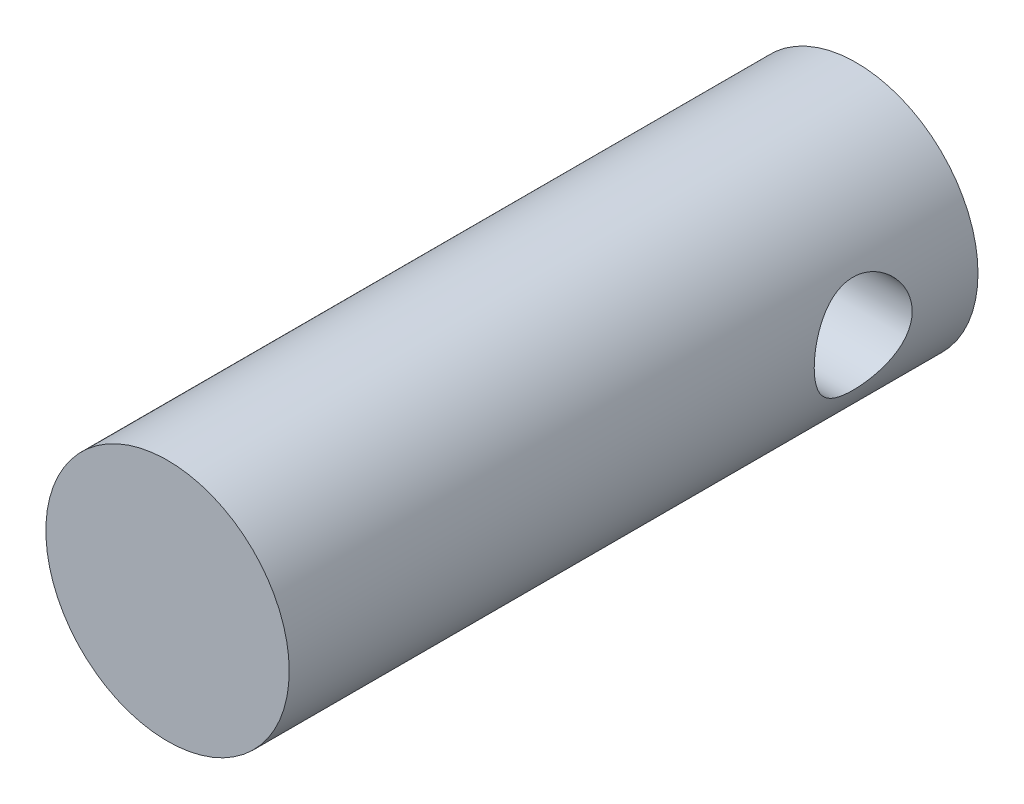
ISO-10303-21;
HEADER;
FILE_DESCRIPTION(('STEP AP214'),'2;1');
FILE_NAME('part.step','',(''),(''),'','','');
FILE_SCHEMA(('AUTOMOTIVE_DESIGN { 1 0 10303 214 1 1 1 1 }'));
ENDSEC;
DATA;
#1=APPLICATION_CONTEXT('core data for automotive mechanical design processes');
#2=APPLICATION_PROTOCOL_DEFINITION('international standard','automotive_design',2000,#1);
#3=PRODUCT_CONTEXT('',#1,'mechanical');
#4=PRODUCT('Part','Part','',(#3));
#5=PRODUCT_RELATED_PRODUCT_CATEGORY('part','',(#4));
#6=PRODUCT_DEFINITION_FORMATION('','',#4);
#7=PRODUCT_DEFINITION_CONTEXT('part definition',#1,'design');
#8=PRODUCT_DEFINITION('design','',#6,#7);
#9=PRODUCT_DEFINITION_SHAPE('','',#8);
#10=(LENGTH_UNIT() NAMED_UNIT(*) SI_UNIT(.MILLI.,.METRE.));
#11=(NAMED_UNIT(*) PLANE_ANGLE_UNIT() SI_UNIT($,.RADIAN.));
#12=(NAMED_UNIT(*) SI_UNIT($,.STERADIAN.) SOLID_ANGLE_UNIT());
#13=UNCERTAINTY_MEASURE_WITH_UNIT(LENGTH_MEASURE(1.E-05),#10,'distance_accuracy_value','');
#14=(GEOMETRIC_REPRESENTATION_CONTEXT(3) GLOBAL_UNCERTAINTY_ASSIGNED_CONTEXT((#13)) GLOBAL_UNIT_ASSIGNED_CONTEXT((#10,
#11,#12)) REPRESENTATION_CONTEXT('',''));
#15=CARTESIAN_POINT('',(0.,0.,0.));
#16=DIRECTION('',(0.,0.,1.));
#17=DIRECTION('',(1.,0.,0.));
#18=AXIS2_PLACEMENT_3D('',#15,#16,#17);
#19=CARTESIAN_POINT('',(0.,0.,90.));
#20=DIRECTION('',(0.,0.,-1.));
#21=DIRECTION('',(-1.,0.,0.));
#22=AXIS2_PLACEMENT_3D('',#19,#20,#21);
#23=CYLINDRICAL_SURFACE('',#22,15.9);
#24=CARTESIAN_POINT('',(15.9,0.,8.60000000000005));
#25=CARTESIAN_POINT('',(15.8999992046562,-0.171980779036634,8.60000101579485));
#26=CARTESIAN_POINT('',(15.8972019298914,-0.344026681142329,8.6069417407459));
#27=CARTESIAN_POINT('',(15.8860828247378,-0.686900204498582,8.63464182974731));
#28=CARTESIAN_POINT('',(15.8777573333585,-0.857726942549671,8.65541035110304));
#29=CARTESIAN_POINT('',(15.8557787232932,-1.19719142710894,8.71061519070985));
#30=CARTESIAN_POINT('',(15.8421142571649,-1.36582371543756,8.74508062302765));
#31=CARTESIAN_POINT('',(15.8098132722622,-1.69938160913937,8.8273485633869));
#32=CARTESIAN_POINT('',(15.7911747217829,-1.86430566994386,8.87515652165675));
#33=CARTESIAN_POINT('',(15.749488448008,-2.18866449638451,8.9834500970956));
#34=CARTESIAN_POINT('',(15.7264574211853,-2.34811743403703,9.04388778740796));
#35=CARTESIAN_POINT('',(15.6765097403794,-2.66123915728213,9.17704830458091));
#36=CARTESIAN_POINT('',(15.6495916353706,-2.81490575573804,9.24977572086352));
#37=CARTESIAN_POINT('',(15.5925519068847,-3.11539498879065,9.40687675256024));
#38=CARTESIAN_POINT('',(15.5624327518265,-3.2622227731112,9.49124140891638));
#39=CARTESIAN_POINT('',(15.4996929804974,-3.54838256121094,9.6710625719418));
#40=CARTESIAN_POINT('',(15.4670714600248,-3.68771182424525,9.76652309445882));
#41=CARTESIAN_POINT('',(15.3637094634824,-4.10494997766084,10.0773075510603));
#42=CARTESIAN_POINT('',(15.2900042466172,-4.36923869957476,10.3103275985045));
#43=CARTESIAN_POINT('',(15.1424065959405,-4.85618110327394,10.8165878470021));
#44=CARTESIAN_POINT('',(15.0685140877324,-5.07881419015128,11.0898478243449));
#45=CARTESIAN_POINT('',(14.9618627232137,-5.38190089373184,11.5317053841374));
#46=CARTESIAN_POINT('',(14.9262900066365,-5.47953249507688,11.6880831703871));
#47=CARTESIAN_POINT('',(14.858344219881,-5.66118399891776,12.0091844038552));
#48=CARTESIAN_POINT('',(14.8259698347619,-5.74520950449056,12.1739043788336));
#49=CARTESIAN_POINT('',(14.7654790200851,-5.89893729754548,12.5106609958747));
#50=CARTESIAN_POINT('',(14.7373628633161,-5.96863866750316,12.682698105781));
#51=CARTESIAN_POINT('',(14.686385383696,-6.09299634195365,13.0327994824035));
#52=CARTESIAN_POINT('',(14.6635214193468,-6.14766021203765,13.2108606674909));
#53=CARTESIAN_POINT('',(14.624778529459,-6.23924784694049,13.5635262184435));
#54=CARTESIAN_POINT('',(14.6086299011431,-6.2768635823761,13.7379212657773));
#55=CARTESIAN_POINT('',(14.5824573630195,-6.33743086259205,14.0896202958677));
#56=CARTESIAN_POINT('',(14.5724306778774,-6.36038905247019,14.2669229230055));
#57=CARTESIAN_POINT('',(14.5588615840443,-6.39138773156405,14.6230370545568));
#58=CARTESIAN_POINT('',(14.5553177620069,-6.39943147232402,14.8018482215475));
#59=CARTESIAN_POINT('',(14.5548435634636,-6.4005102311764,15.15952034877));
#60=CARTESIAN_POINT('',(14.5579128727916,-6.39354596224534,15.3383813062328));
#61=CARTESIAN_POINT('',(14.5700985332043,-6.36572337785981,15.6820134716738));
#62=CARTESIAN_POINT('',(14.5787706047808,-6.34588542331798,15.8468843420816));
#63=CARTESIAN_POINT('',(14.6014473318304,-6.29353233142194,16.1742833460062));
#64=CARTESIAN_POINT('',(14.6154537406496,-6.26101302574378,16.3368106909791));
#65=CARTESIAN_POINT('',(14.6483626285174,-6.18362644326438,16.6583434764584));
#66=CARTESIAN_POINT('',(14.6672639377121,-6.13876211669411,16.8173497486386));
#67=CARTESIAN_POINT('',(14.7094127472312,-6.03706914652594,17.1309578704793));
#68=CARTESIAN_POINT('',(14.7326619182897,-5.98023590262147,17.2855580006049));
#69=CARTESIAN_POINT('',(14.7833534465297,-5.85381829324504,17.5924715484894));
#70=CARTESIAN_POINT('',(14.8108708346101,-5.78400013929312,17.744676175697));
#71=CARTESIAN_POINT('',(14.8689898197706,-5.63291150693005,18.0427350302866));
#72=CARTESIAN_POINT('',(14.8995924598104,-5.55163715206476,18.1885870861807));
#73=CARTESIAN_POINT('',(14.9630749112561,-5.37818889802826,18.4731621221998));
#74=CARTESIAN_POINT('',(14.9959550320767,-5.28601351665445,18.6118841291713));
#75=CARTESIAN_POINT('',(15.0631677015387,-5.09132431569727,18.881503590249));
#76=CARTESIAN_POINT('',(15.0975003260537,-4.98880995565572,19.0124006347441));
#77=CARTESIAN_POINT('',(15.1695190483268,-4.76555400222129,19.2756964832055));
#78=CARTESIAN_POINT('',(15.2072566046043,-4.64401305838589,19.4074044723956));
#79=CARTESIAN_POINT('',(15.2824291858421,-4.39031372358851,19.6601718078636));
#80=CARTESIAN_POINT('',(15.3198642964914,-4.25815846492082,19.7812342737146));
#81=CARTESIAN_POINT('',(15.3934716045971,-3.98386785351345,20.0120798831525));
#82=CARTESIAN_POINT('',(15.4296430560319,-3.84172674971576,20.1218564358018));
#83=CARTESIAN_POINT('',(15.4997275289986,-3.54840418418615,20.3292662209025));
#84=CARTESIAN_POINT('',(15.5336414500985,-3.39722636948439,20.4269043038433));
#85=CARTESIAN_POINT('',(15.5989923654703,-3.0834466106694,20.6112518623245));
#86=CARTESIAN_POINT('',(15.6303633692958,-2.9206727177749,20.6976925602306));
#87=CARTESIAN_POINT('',(15.6889218536697,-2.5877184386177,20.8564247524691));
#88=CARTESIAN_POINT('',(15.7161110184857,-2.4175410697759,20.9287219464129));
#89=CARTESIAN_POINT('',(15.7655242719524,-2.07095973742492,21.0584945992748));
#90=CARTESIAN_POINT('',(15.7877493686396,-1.89455704651151,21.1159730677482));
#91=CARTESIAN_POINT('',(15.8265740021245,-1.53685050875672,21.2155086838733));
#92=CARTESIAN_POINT('',(15.8431739339858,-1.35554700707256,21.2575669145281));
#93=CARTESIAN_POINT('',(15.8694302386116,-1.00047851244443,21.3237393494539));
#94=CARTESIAN_POINT('',(15.8794425938282,-0.826911406704495,21.3487765161915));
#95=CARTESIAN_POINT('',(15.8937694567169,-0.478077479010072,21.3845264334986));
#96=CARTESIAN_POINT('',(15.898084249591,-0.302810742576149,21.3952399010674));
#97=CARTESIAN_POINT('',(15.9008949797389,0.0480167596019802,21.4022239112365));
#98=CARTESIAN_POINT('',(15.899392218756,0.223577450783179,21.398497684881));
#99=CARTESIAN_POINT('',(15.890612874211,0.573652873036684,21.376650995696));
#100=CARTESIAN_POINT('',(15.8833364038866,0.748167624555007,21.35853081517));
#101=CARTESIAN_POINT('',(15.8636759910127,1.08684371917325,21.3092550019988));
#102=CARTESIAN_POINT('',(15.8515417039289,1.25111271986699,21.2787355984077));
#103=CARTESIAN_POINT('',(15.8225026204763,1.57641555386155,21.2050572492848));
#104=CARTESIAN_POINT('',(15.8055962643291,1.73744831091186,21.1618941709199));
#105=CARTESIAN_POINT('',(15.7674344048377,2.05514109149949,21.063336527423));
#106=CARTESIAN_POINT('',(15.7461801115466,2.21180231790048,21.0079453650902));
#107=CARTESIAN_POINT('',(15.6998191075175,2.51991334570503,20.8853664900806));
#108=CARTESIAN_POINT('',(15.6747109314594,2.671361137933,20.8181742890148));
#109=CARTESIAN_POINT('',(15.6204223535534,2.97263156069611,20.6703143629803));
#110=CARTESIAN_POINT('',(15.5911416258518,3.12226595280605,20.5893000587608));
#111=CARTESIAN_POINT('',(15.5298155195094,3.41424889554771,20.4158793419747));
#112=CARTESIAN_POINT('',(15.4977691948828,3.55659492642112,20.323469026674));
#113=CARTESIAN_POINT('',(15.4316760705943,3.83322344572601,20.1278746395005));
#114=CARTESIAN_POINT('',(15.3976289303789,3.96750455353755,20.0246887312065));
#115=CARTESIAN_POINT('',(15.3283406318083,4.22729834005113,19.8081748158737));
#116=CARTESIAN_POINT('',(15.2930994206059,4.35281062990686,19.6948463595794));
#117=CARTESIAN_POINT('',(15.2198779513594,4.60253878964319,19.450745197925));
#118=CARTESIAN_POINT('',(15.1818725424002,4.72610284685502,19.31931226977));
#119=CARTESIAN_POINT('',(15.1065019443627,4.96174371208003,19.0464291231229));
#120=CARTESIAN_POINT('',(15.0691365601505,5.07382407514638,18.9049820278259));
#121=CARTESIAN_POINT('',(14.996064959701,5.28588912620612,18.6127531627669));
#122=CARTESIAN_POINT('',(14.9603597176574,5.38586676598188,18.4619660302103));
#123=CARTESIAN_POINT('',(14.8916994970906,5.57289961712084,18.1520674870494));
#124=CARTESIAN_POINT('',(14.8587433657092,5.65996025736234,17.9929596118102));
#125=CARTESIAN_POINT('',(14.796252257462,5.8213826771679,17.6655532879886));
#126=CARTESIAN_POINT('',(14.7667583250609,5.89559626547635,17.4971737895017));
#127=CARTESIAN_POINT('',(14.7126195767109,6.02943113605665,17.1540326649408));
#128=CARTESIAN_POINT('',(14.6879726821792,6.08905867603376,16.9792738128485));
#129=CARTESIAN_POINT('',(14.6444042866243,6.19310975450465,16.6246599616867));
#130=CARTESIAN_POINT('',(14.6254804604948,6.23753946837111,16.4448070647373));
#131=CARTESIAN_POINT('',(14.5940618972613,6.31070122141686,16.0813868297466));
#132=CARTESIAN_POINT('',(14.5815666122505,6.33943459841346,15.8978198096479));
#133=CARTESIAN_POINT('',(14.5641515520773,6.37933563308827,15.5419946822661));
#134=CARTESIAN_POINT('',(14.5587466469697,6.39162945768454,15.3698857759562));
#135=CARTESIAN_POINT('',(14.5540694038607,6.40227305916049,15.0251564873787));
#136=CARTESIAN_POINT('',(14.5547967983399,6.40062344431801,14.8525361277517));
#137=CARTESIAN_POINT('',(14.5623583031283,6.38340091413453,14.5081508015));
#138=CARTESIAN_POINT('',(14.5691916563495,6.36782972495292,14.3363857314816));
#139=CARTESIAN_POINT('',(14.5887277650361,6.32294389293203,13.9950025762418));
#140=CARTESIAN_POINT('',(14.601430490736,6.29362931978993,13.8253844801368));
#141=CARTESIAN_POINT('',(14.631646666526,6.22304767608885,13.4963986042574));
#142=CARTESIAN_POINT('',(14.6489425167004,6.1823174995948,13.336895073415));
#143=CARTESIAN_POINT('',(14.6880303399516,6.08886922423271,13.021954504783));
#144=CARTESIAN_POINT('',(14.7098237764038,6.03614722302409,12.8665188091358));
#145=CARTESIAN_POINT('',(14.7572846200712,5.91916635648656,12.5606836643214));
#146=CARTESIAN_POINT('',(14.7829515146057,5.85490901773155,12.4102835518719));
#147=CARTESIAN_POINT('',(14.8374708635361,5.71533636170774,12.1152829722362));
#148=CARTESIAN_POINT('',(14.8663244745706,5.64001702612599,11.9706846369728));
#149=CARTESIAN_POINT('',(14.9600199944031,5.38896238505551,11.5305207292207));
#150=CARTESIAN_POINT('',(15.0291618180781,5.19479618080253,11.2461257910192));
#151=CARTESIAN_POINT('',(15.1712090270879,4.76399896256803,10.7125808220985));
#152=CARTESIAN_POINT('',(15.2441155678605,4.52735485575308,10.4634417006329));
#153=CARTESIAN_POINT('',(15.3532526130609,4.13614274027789,10.1126912440407));
#154=CARTESIAN_POINT('',(15.3907289227547,3.99477410370612,9.99646958681593));
#155=CARTESIAN_POINT('',(15.4636897415585,3.70229344921914,9.77635332911503));
#156=CARTESIAN_POINT('',(15.4991749767738,3.55118502697824,9.67245421925271));
#157=CARTESIAN_POINT('',(15.5672067392973,3.23998034715245,9.47765762898821));
#158=CARTESIAN_POINT('',(15.5997504783079,3.0798757902839,9.38677243802486));
#159=CARTESIAN_POINT('',(15.6609338092513,2.75190077341183,9.21891397471958));
#160=CARTESIAN_POINT('',(15.6895751858439,2.58403391069327,9.14193433769463));
#161=CARTESIAN_POINT('',(15.7416740245942,2.2446908332941,9.00380785313219));
#162=CARTESIAN_POINT('',(15.7652149271866,2.07333260867143,8.9424028128873));
#163=CARTESIAN_POINT('',(15.8070660292477,1.72549289722599,8.83430283618504));
#164=CARTESIAN_POINT('',(15.8253786888982,1.5490138632426,8.78760097998742));
#165=CARTESIAN_POINT('',(15.8562103860179,1.192685219413,8.70947590910469));
#166=CARTESIAN_POINT('',(15.8687439334392,1.01284524379849,8.67801441937969));
#167=CARTESIAN_POINT('',(15.8877030894662,0.650907303351227,8.63057401569034));
#168=CARTESIAN_POINT('',(15.8941333013184,0.468811145355432,8.6145834331109));
#169=CARTESIAN_POINT('',(15.8982801359629,0.238689885047848,8.60427399774469));
#170=CARTESIAN_POINT('',(15.8989247954345,0.190969696197969,8.60267161556677));
#171=CARTESIAN_POINT('',(15.899784837858,0.0955013451901639,8.6005344757058));
#172=CARTESIAN_POINT('',(15.9000002208398,0.0477531830341818,8.59999971794856));
#173=CARTESIAN_POINT('',(15.9,0.,8.60000000000005));
#174=B_SPLINE_CURVE_WITH_KNOTS('',3,(#24,#25,#26,#27,#28,#29,#30,#31,#32,#33,#34,#35,#36,#37,
#38,#39,#40,#41,#42,#43,#44,#45,#46,#47,#48,#49,#50,#51,#52,#53,#54,#55,#56,#57,#58,#59,#60,#61,
#62,#63,#64,#65,#66,#67,#68,#69,#70,#71,#72,#73,#74,#75,#76,#77,#78,#79,#80,#81,#82,#83,#84,#85,
#86,#87,#88,#89,#90,#91,#92,#93,#94,#95,#96,#97,#98,#99,#100,#101,#102,#103,#104,#105,#106,#107,
#108,#109,#110,#111,#112,#113,#114,#115,#116,#117,#118,#119,#120,#121,#122,#123,#124,#125,#126,
#127,#128,#129,#130,#131,#132,#133,#134,#135,#136,#137,#138,#139,#140,#141,#142,#143,#144,#145,
#146,#147,#148,#149,#150,#151,#152,#153,#154,#155,#156,#157,#158,#159,#160,#161,#162,#163,#164,
#165,#166,#167,#168,#169,#170,#171,#172,#173),.UNSPECIFIED.,.T.,.F.,(4,2,2,2,2,2,2,2,2,2,2,2,2,
2,2,2,2,2,2,2,2,2,2,2,2,2,2,2,2,2,2,2,2,2,2,2,2,2,2,2,2,2,2,2,2,2,2,2,2,2,2,2,2,2,2,2,2,2,2,2,2,
2,2,2,2,2,2,2,2,2,2,2,2,2,4),(0.,0.515893332174278,1.03212864927339,1.54946719279154,
2.06701737169308,2.58263811915994,3.09845184505425,3.61387065960741,4.12947660028804,
5.20438011612308,6.27981367736149,6.84247786956677,7.40490976054105,7.96737766655235,
8.52956206682341,9.0662566915096,9.60270782894285,10.1390419992802,10.675350690873,
11.1736255476637,11.6720643242171,12.17038408645,12.6688957308023,13.1774489992852,
13.6861747627371,14.1949697768642,14.703791401463,15.2526111099129,15.8012694520541,
16.3502464102442,16.8990032892311,17.4591457647486,18.0190620444886,18.5788645203305,
19.1386276722684,19.6649034798954,20.191152942826,20.7172846583087,21.2434060552084,
21.7453882867027,22.2475347843751,22.7495417217796,23.2517400068446,23.769152729895,
24.2867431433241,24.8044219110637,25.3221236203077,25.8745549825915,26.4268148064583,
26.9793947161666,27.53174172046,28.0900877330723,28.6481937823477,29.2060727847872,
29.7639042311199,30.2811395179593,30.7983522407005,31.3155008422597,31.8326468212184,
32.3286776002339,32.8248700274971,33.3209968375425,33.8173043153614,34.8662146060752,
35.9154487560802,36.4752995343881,37.0349448012631,37.5951151212239,38.1550283934859,
38.7049427265099,39.2545978658485,39.8028653370267,40.3507189655727,40.4939649176327,
40.6372108597399),.UNSPECIFIED.);
#175=CARTESIAN_POINT('',(15.9,0.,8.60000000000005));
#176=VERTEX_POINT('',#175);
#177=EDGE_CURVE('E10',#176,#176,#174,.T.);
#178=ORIENTED_EDGE('',*,*,#177,.T.);
#179=EDGE_LOOP('',(#178));
#180=FACE_BOUND('',#179,.T.);
#181=CARTESIAN_POINT('',(-15.9,0.,21.4));
#182=CARTESIAN_POINT('',(-15.8999992046562,-0.171980779036632,21.3999989842052));
#183=CARTESIAN_POINT('',(-15.8972019298914,-0.344026681142326,21.3930582592542));
#184=CARTESIAN_POINT('',(-15.8860828247378,-0.686900204498576,21.3653581702527));
#185=CARTESIAN_POINT('',(-15.8777573333585,-0.857726942549666,21.344589648897));
#186=CARTESIAN_POINT('',(-15.8557787232932,-1.19719142710893,21.2893848092902));
#187=CARTESIAN_POINT('',(-15.8421142571649,-1.36582371543755,21.2549193769724));
#188=CARTESIAN_POINT('',(-15.8098132722622,-1.69938160913936,21.1726514366132));
#189=CARTESIAN_POINT('',(-15.7911747217829,-1.86430566994386,21.1248434783433));
#190=CARTESIAN_POINT('',(-15.749488448008,-2.18866449638451,21.0165499029045));
#191=CARTESIAN_POINT('',(-15.7264574211853,-2.34811743403703,20.9561122125921));
#192=CARTESIAN_POINT('',(-15.6765097403794,-2.66123915728213,20.8229516954191));
#193=CARTESIAN_POINT('',(-15.6495916353706,-2.81490575573804,20.7502242791365));
#194=CARTESIAN_POINT('',(-15.5925519068847,-3.11539498879065,20.5931232474398));
#195=CARTESIAN_POINT('',(-15.5624327518265,-3.2622227731112,20.5087585910837));
#196=CARTESIAN_POINT('',(-15.4996929804974,-3.54838256121094,20.3289374280583));
#197=CARTESIAN_POINT('',(-15.4670714600248,-3.68771182424524,20.2334769055412));
#198=CARTESIAN_POINT('',(-15.3637094634824,-4.10494997766084,19.9226924489397));
#199=CARTESIAN_POINT('',(-15.2900042466172,-4.36923869957477,19.6896724014955));
#200=CARTESIAN_POINT('',(-15.1424065959405,-4.85618110327395,19.1834121529979));
#201=CARTESIAN_POINT('',(-15.0685140877324,-5.07881419015128,18.9101521756552));
#202=CARTESIAN_POINT('',(-14.9618627232137,-5.38190089373184,18.4682946158626));
#203=CARTESIAN_POINT('',(-14.9262900066365,-5.47953249507688,18.311916829613));
#204=CARTESIAN_POINT('',(-14.858344219881,-5.66118399891776,17.9908155961448));
#205=CARTESIAN_POINT('',(-14.8259698347619,-5.74520950449056,17.8260956211664));
#206=CARTESIAN_POINT('',(-14.7654790200851,-5.89893729754548,17.4893390041253));
#207=CARTESIAN_POINT('',(-14.7373628633161,-5.96863866750316,17.317301894219));
#208=CARTESIAN_POINT('',(-14.686385383696,-6.09299634195364,16.9672005175966));
#209=CARTESIAN_POINT('',(-14.6635214193468,-6.14766021203765,16.7891393325092));
#210=CARTESIAN_POINT('',(-14.624778529459,-6.23924784694049,16.4364737815566));
#211=CARTESIAN_POINT('',(-14.6086299011431,-6.2768635823761,16.2620787342228));
#212=CARTESIAN_POINT('',(-14.5824573630195,-6.33743086259205,15.9103797041324));
#213=CARTESIAN_POINT('',(-14.5724306778774,-6.36038905247019,15.7330770769945));
#214=CARTESIAN_POINT('',(-14.5588615840443,-6.39138773156405,15.3769629454433));
#215=CARTESIAN_POINT('',(-14.5553177620069,-6.39943147232402,15.1981517784526));
#216=CARTESIAN_POINT('',(-14.5548435634636,-6.4005102311764,14.8404796512301));
#217=CARTESIAN_POINT('',(-14.5579128727916,-6.39354596224534,14.6616186937672));
#218=CARTESIAN_POINT('',(-14.5700985332043,-6.36572337785981,14.3179865283263));
#219=CARTESIAN_POINT('',(-14.5787706047808,-6.34588542331798,14.1531156579184));
#220=CARTESIAN_POINT('',(-14.6014473318304,-6.29353233142194,13.8257166539938));
#221=CARTESIAN_POINT('',(-14.6154537406496,-6.26101302574378,13.6631893090209));
#222=CARTESIAN_POINT('',(-14.6483626285174,-6.18362644326438,13.3416565235416));
#223=CARTESIAN_POINT('',(-14.6672639377121,-6.13876211669411,13.1826502513615));
#224=CARTESIAN_POINT('',(-14.7094127472312,-6.03706914652594,12.8690421295208));
#225=CARTESIAN_POINT('',(-14.7326619182897,-5.98023590262147,12.7144419993951));
#226=CARTESIAN_POINT('',(-14.7833534465298,-5.85381829324504,12.4075284515107));
#227=CARTESIAN_POINT('',(-14.8108708346101,-5.78400013929312,12.2553238243031));
#228=CARTESIAN_POINT('',(-14.8689898197706,-5.63291150693005,11.9572649697135));
#229=CARTESIAN_POINT('',(-14.8995924598104,-5.55163715206476,11.8114129138194));
#230=CARTESIAN_POINT('',(-14.9630749112561,-5.37818889802826,11.5268378778002));
#231=CARTESIAN_POINT('',(-14.9959550320767,-5.28601351665445,11.3881158708287));
#232=CARTESIAN_POINT('',(-15.0631677015387,-5.09132431569727,11.118496409751));
#233=CARTESIAN_POINT('',(-15.0975003260537,-4.98880995565572,10.987599365256));
#234=CARTESIAN_POINT('',(-15.1695190483268,-4.76555400222129,10.7243035167946));
#235=CARTESIAN_POINT('',(-15.2072566046043,-4.64401305838589,10.5925955276045));
#236=CARTESIAN_POINT('',(-15.2824291858421,-4.39031372358852,10.3398281921365));
#237=CARTESIAN_POINT('',(-15.3198642964914,-4.25815846492082,10.2187657262854));
#238=CARTESIAN_POINT('',(-15.3934716045971,-3.98386785351345,9.98792011684758));
#239=CARTESIAN_POINT('',(-15.4296430560319,-3.84172674971576,9.87814356419826));
#240=CARTESIAN_POINT('',(-15.4997275289986,-3.54840418418616,9.67073377909757));
#241=CARTESIAN_POINT('',(-15.5336414500985,-3.39722636948439,9.57309569615677));
#242=CARTESIAN_POINT('',(-15.5989923654703,-3.0834466106694,9.3887481376756));
#243=CARTESIAN_POINT('',(-15.6303633692958,-2.9206727177749,9.3023074397695));
#244=CARTESIAN_POINT('',(-15.6889218536697,-2.5877184386177,9.143575247531));
#245=CARTESIAN_POINT('',(-15.7161110184857,-2.4175410697759,9.0712780535872));
#246=CARTESIAN_POINT('',(-15.7655242719524,-2.07095973742492,8.94150540072522));
#247=CARTESIAN_POINT('',(-15.7877493686396,-1.89455704651151,8.88402693225187));
#248=CARTESIAN_POINT('',(-15.8265740021245,-1.53685050875672,8.78449131612673));
#249=CARTESIAN_POINT('',(-15.8431739339858,-1.35554700707257,8.74243308547195));
#250=CARTESIAN_POINT('',(-15.8694302386116,-1.00047851244444,8.6762606505462));
#251=CARTESIAN_POINT('',(-15.8794425938282,-0.826911406704502,8.65122348380857));
#252=CARTESIAN_POINT('',(-15.8937694567169,-0.478077479010078,8.61547356650143));
#253=CARTESIAN_POINT('',(-15.898084249591,-0.302810742576155,8.60476009893263));
#254=CARTESIAN_POINT('',(-15.9008949797389,0.0480167596019753,8.59777608876357));
#255=CARTESIAN_POINT('',(-15.899392218756,0.223577450783173,8.60150231511907));
#256=CARTESIAN_POINT('',(-15.890612874211,0.573652873036679,8.6233490043041));
#257=CARTESIAN_POINT('',(-15.8833364038866,0.748167624555003,8.64146918483003));
#258=CARTESIAN_POINT('',(-15.8636759910127,1.08684371917325,8.69074499800126));
#259=CARTESIAN_POINT('',(-15.8515417039289,1.25111271986698,8.72126440159233));
#260=CARTESIAN_POINT('',(-15.8225026204763,1.57641555386155,8.79494275071529));
#261=CARTESIAN_POINT('',(-15.8055962643291,1.73744831091186,8.83810582908016));
#262=CARTESIAN_POINT('',(-15.7674344048377,2.05514109149949,8.9366634725771));
#263=CARTESIAN_POINT('',(-15.7461801115466,2.21180231790048,8.99205463490984));
#264=CARTESIAN_POINT('',(-15.6998191075175,2.51991334570502,9.11463350991948));
#265=CARTESIAN_POINT('',(-15.6747109314594,2.67136113793299,9.18182571098524));
#266=CARTESIAN_POINT('',(-15.6204223535534,2.97263156069611,9.32968563701971));
#267=CARTESIAN_POINT('',(-15.5911416258518,3.12226595280605,9.41069994123927));
#268=CARTESIAN_POINT('',(-15.5298155195094,3.41424889554771,9.58412065802534));
#269=CARTESIAN_POINT('',(-15.4977691948828,3.55659492642112,9.67653097332607));
#270=CARTESIAN_POINT('',(-15.4316760705943,3.83322344572601,9.87212536049951));
#271=CARTESIAN_POINT('',(-15.3976289303789,3.96750455353755,9.97531126879354));
#272=CARTESIAN_POINT('',(-15.3283406318083,4.22729834005113,10.1918251841263));
#273=CARTESIAN_POINT('',(-15.2930994206059,4.35281062990686,10.3051536404207));
#274=CARTESIAN_POINT('',(-15.2198779513594,4.60253878964319,10.5492548020751));
#275=CARTESIAN_POINT('',(-15.1818725424002,4.72610284685502,10.68068773023));
#276=CARTESIAN_POINT('',(-15.1065019443627,4.96174371208003,10.9535708768771));
#277=CARTESIAN_POINT('',(-15.0691365601505,5.07382407514638,11.0950179721741));
#278=CARTESIAN_POINT('',(-14.996064959701,5.28588912620612,11.3872468372332));
#279=CARTESIAN_POINT('',(-14.9603597176574,5.38586676598188,11.5380339697897));
#280=CARTESIAN_POINT('',(-14.8916994970906,5.57289961712084,11.8479325129506));
#281=CARTESIAN_POINT('',(-14.8587433657092,5.65996025736234,12.0070403881899));
#282=CARTESIAN_POINT('',(-14.796252257462,5.8213826771679,12.3344467120115));
#283=CARTESIAN_POINT('',(-14.7667583250609,5.89559626547635,12.5028262104983));
#284=CARTESIAN_POINT('',(-14.7126195767109,6.02943113605665,12.8459673350593));
#285=CARTESIAN_POINT('',(-14.6879726821792,6.08905867603376,13.0207261871516));
#286=CARTESIAN_POINT('',(-14.6444042866243,6.19310975450465,13.3753400383133));
#287=CARTESIAN_POINT('',(-14.6254804604948,6.23753946837111,13.5551929352628));
#288=CARTESIAN_POINT('',(-14.5940618972613,6.31070122141686,13.9186131702535));
#289=CARTESIAN_POINT('',(-14.5815666122505,6.33943459841346,14.1021801903522));
#290=CARTESIAN_POINT('',(-14.5641515520773,6.37933563308827,14.4580053177339));
#291=CARTESIAN_POINT('',(-14.5587466469697,6.39162945768454,14.6301142240439));
#292=CARTESIAN_POINT('',(-14.5540694038607,6.40227305916049,14.9748435126213));
#293=CARTESIAN_POINT('',(-14.5547967983399,6.40062344431801,15.1474638722484));
#294=CARTESIAN_POINT('',(-14.5623583031283,6.38340091413453,15.4918491985001));
#295=CARTESIAN_POINT('',(-14.5691916563495,6.36782972495292,15.6636142685185));
#296=CARTESIAN_POINT('',(-14.5887277650361,6.32294389293203,16.0049974237583));
#297=CARTESIAN_POINT('',(-14.601430490736,6.29362931978993,16.1746155198633));
#298=CARTESIAN_POINT('',(-14.631646666526,6.22304767608885,16.5036013957427));
#299=CARTESIAN_POINT('',(-14.6489425167004,6.1823174995948,16.6631049265851));
#300=CARTESIAN_POINT('',(-14.6880303399516,6.08886922423271,16.9780454952171));
#301=CARTESIAN_POINT('',(-14.7098237764038,6.03614722302409,17.1334811908643));
#302=CARTESIAN_POINT('',(-14.7572846200712,5.91916635648656,17.4393163356786));
#303=CARTESIAN_POINT('',(-14.7829515146057,5.85490901773155,17.5897164481282));
#304=CARTESIAN_POINT('',(-14.8374708635361,5.71533636170774,17.8847170277638));
#305=CARTESIAN_POINT('',(-14.8663244745706,5.64001702612599,18.0293153630272));
#306=CARTESIAN_POINT('',(-14.9600199944031,5.38896238505551,18.4694792707794));
#307=CARTESIAN_POINT('',(-15.0291618180781,5.19479618080254,18.7538742089808));
#308=CARTESIAN_POINT('',(-15.1712090270879,4.76399896256803,19.2874191779016));
#309=CARTESIAN_POINT('',(-15.2441155678605,4.52735485575308,19.5365582993671));
#310=CARTESIAN_POINT('',(-15.3532526130609,4.13614274027789,19.8873087559593));
#311=CARTESIAN_POINT('',(-15.3907289227547,3.99477410370612,20.0035304131841));
#312=CARTESIAN_POINT('',(-15.4636897415585,3.70229344921914,20.223646670885));
#313=CARTESIAN_POINT('',(-15.4991749767738,3.55118502697824,20.3275457807473));
#314=CARTESIAN_POINT('',(-15.5672067392973,3.23998034715245,20.5223423710118));
#315=CARTESIAN_POINT('',(-15.5997504783079,3.07987579028391,20.6132275619752));
#316=CARTESIAN_POINT('',(-15.6609338092513,2.75190077341184,20.7810860252805));
#317=CARTESIAN_POINT('',(-15.6895751858439,2.58403391069327,20.8580656623054));
#318=CARTESIAN_POINT('',(-15.7416740245942,2.24469083329411,20.9961921468679));
#319=CARTESIAN_POINT('',(-15.7652149271866,2.07333260867143,21.0575971871128));
#320=CARTESIAN_POINT('',(-15.8070660292477,1.725492897226,21.165697163815));
#321=CARTESIAN_POINT('',(-15.8253786888982,1.54901386324261,21.2123990200126));
#322=CARTESIAN_POINT('',(-15.8562103860179,1.19268521941301,21.2905240908954));
#323=CARTESIAN_POINT('',(-15.8687439334392,1.0128452437985,21.3219855806204));
#324=CARTESIAN_POINT('',(-15.8877030894662,0.65090730335123,21.3694259843097));
#325=CARTESIAN_POINT('',(-15.8941333013184,0.468811145355434,21.3854165668892));
#326=CARTESIAN_POINT('',(-15.8982801359629,0.23868988504785,21.3957260022554));
#327=CARTESIAN_POINT('',(-15.8989247954345,0.190969696197972,21.3973283844333));
#328=CARTESIAN_POINT('',(-15.899784837858,0.0955013451901665,21.3994655242943));
#329=CARTESIAN_POINT('',(-15.9000002208398,0.0477531830341831,21.4000002820515));
#330=CARTESIAN_POINT('',(-15.9,0.,21.4));
#331=B_SPLINE_CURVE_WITH_KNOTS('',3,(#181,#182,#183,#184,#185,#186,#187,#188,#189,#190,#191,
#192,#193,#194,#195,#196,#197,#198,#199,#200,#201,#202,#203,#204,#205,#206,#207,#208,#209,#210,
#211,#212,#213,#214,#215,#216,#217,#218,#219,#220,#221,#222,#223,#224,#225,#226,#227,#228,#229,
#230,#231,#232,#233,#234,#235,#236,#237,#238,#239,#240,#241,#242,#243,#244,#245,#246,#247,#248,
#249,#250,#251,#252,#253,#254,#255,#256,#257,#258,#259,#260,#261,#262,#263,#264,#265,#266,#267,
#268,#269,#270,#271,#272,#273,#274,#275,#276,#277,#278,#279,#280,#281,#282,#283,#284,#285,#286,
#287,#288,#289,#290,#291,#292,#293,#294,#295,#296,#297,#298,#299,#300,#301,#302,#303,#304,#305,
#306,#307,#308,#309,#310,#311,#312,#313,#314,#315,#316,#317,#318,#319,#320,#321,#322,#323,#324,
#325,#326,#327,#328,#329,#330),.UNSPECIFIED.,.T.,.F.,(4,2,2,2,2,2,2,2,2,2,2,2,2,2,2,2,2,2,2,2,2,
2,2,2,2,2,2,2,2,2,2,2,2,2,2,2,2,2,2,2,2,2,2,2,2,2,2,2,2,2,2,2,2,2,2,2,2,2,2,2,2,2,2,2,2,2,2,2,2,
2,2,2,2,2,4),(0.,0.515893332174274,1.03212864927338,1.54946719279154,2.06701737169308,
2.58263811915994,3.09845184505426,3.61387065960741,4.12947660028804,5.20438011612308,
6.27981367736149,6.84247786956676,7.40490976054105,7.96737766655235,8.5295620668234,
9.06625669150959,9.60270782894285,10.1390419992802,10.675350690873,11.1736255476637,
11.6720643242171,12.17038408645,12.6688957308023,13.1774489992852,13.6861747627371,
14.1949697768642,14.703791401463,15.2526111099129,15.8012694520541,16.3502464102442,
16.8990032892311,17.4591457647486,18.0190620444886,18.5788645203305,19.1386276722684,
19.6649034798954,20.191152942826,20.7172846583087,21.2434060552084,21.7453882867027,
22.2475347843751,22.7495417217796,23.2517400068446,23.769152729895,24.2867431433241,
24.8044219110637,25.3221236203077,25.8745549825915,26.4268148064583,26.9793947161666,
27.53174172046,28.0900877330723,28.6481937823477,29.2060727847872,29.7639042311199,
30.2811395179593,30.7983522407005,31.3155008422597,31.8326468212184,32.3286776002339,
32.8248700274971,33.3209968375425,33.8173043153613,34.8662146060752,35.9154487560802,
36.4752995343881,37.0349448012631,37.5951151212239,38.1550283934859,38.7049427265098,
39.2545978658485,39.8028653370266,40.3507189655727,40.4939649176327,40.6372108597399),.UNSPECIFIED.);
#332=CARTESIAN_POINT('',(-15.9,0.,21.4));
#333=VERTEX_POINT('',#332);
#334=EDGE_CURVE('E47',#333,#333,#331,.T.);
#335=ORIENTED_EDGE('',*,*,#334,.T.);
#336=EDGE_LOOP('',(#335));
#337=FACE_BOUND('',#336,.T.);
#338=CARTESIAN_POINT('',(0.,0.,90.));
#339=DIRECTION('',(0.,0.,1.));
#340=DIRECTION('',(1.,0.,0.));
#341=AXIS2_PLACEMENT_3D('',#338,#339,#340);
#342=CIRCLE('',#341,15.9);
#343=CARTESIAN_POINT('',(15.9,0.,90.));
#344=VERTEX_POINT('',#343);
#345=EDGE_CURVE('E38',#344,#344,#342,.T.);
#346=ORIENTED_EDGE('',*,*,#345,.F.);
#347=EDGE_LOOP('',(#346));
#348=FACE_BOUND('',#347,.T.);
#349=CARTESIAN_POINT('',(0.,0.,0.));
#350=DIRECTION('',(0.,0.,1.));
#351=DIRECTION('',(1.,0.,0.));
#352=AXIS2_PLACEMENT_3D('',#349,#350,#351);
#353=CIRCLE('',#352,15.9);
#354=CARTESIAN_POINT('',(15.9,0.,0.));
#355=VERTEX_POINT('',#354);
#356=EDGE_CURVE('E42',#355,#355,#353,.T.);
#357=ORIENTED_EDGE('',*,*,#356,.T.);
#358=EDGE_LOOP('',(#357));
#359=FACE_BOUND('',#358,.T.);
#360=ADVANCED_FACE('F28',(#180,#337,#348,#359),#23,.T.);
#361=CARTESIAN_POINT('',(0.,0.,90.));
#362=DIRECTION('',(0.,0.,1.));
#363=DIRECTION('',(1.,0.,0.));
#364=AXIS2_PLACEMENT_3D('',#361,#362,#363);
#365=PLANE('',#364);
#366=ORIENTED_EDGE('',*,*,#345,.T.);
#367=EDGE_LOOP('',(#366));
#368=FACE_BOUND('',#367,.T.);
#369=ADVANCED_FACE('F58',(#368),#365,.T.);
#370=CARTESIAN_POINT('',(0.,0.,0.));
#371=DIRECTION('',(0.,0.,1.));
#372=DIRECTION('',(1.,0.,0.));
#373=AXIS2_PLACEMENT_3D('',#370,#371,#372);
#374=PLANE('',#373);
#375=ORIENTED_EDGE('',*,*,#356,.F.);
#376=EDGE_LOOP('',(#375));
#377=FACE_BOUND('',#376,.T.);
#378=ADVANCED_FACE('F56',(#377),#374,.F.);
#379=CARTESIAN_POINT('',(15.9,0.,15.));
#380=DIRECTION('',(1.,0.,0.));
#381=DIRECTION('',(0.,0.,-1.));
#382=AXIS2_PLACEMENT_3D('',#379,#380,#381);
#383=CYLINDRICAL_SURFACE('',#382,6.39999999999995);
#384=ORIENTED_EDGE('',*,*,#334,.F.);
#385=EDGE_LOOP('',(#384));
#386=FACE_BOUND('',#385,.T.);
#387=ORIENTED_EDGE('',*,*,#177,.F.);
#388=EDGE_LOOP('',(#387));
#389=FACE_BOUND('',#388,.T.);
#390=ADVANCED_FACE('F52',(#386,#389),#383,.F.);
#391=CLOSED_SHELL('',(#360,#369,#378,#390));
#392=MANIFOLD_SOLID_BREP('B2',#391);
#393=ADVANCED_BREP_SHAPE_REPRESENTATION('',(#18,#392),#14);
#394=SHAPE_DEFINITION_REPRESENTATION(#9,#393);
ENDSEC;
END-ISO-10303-21;
